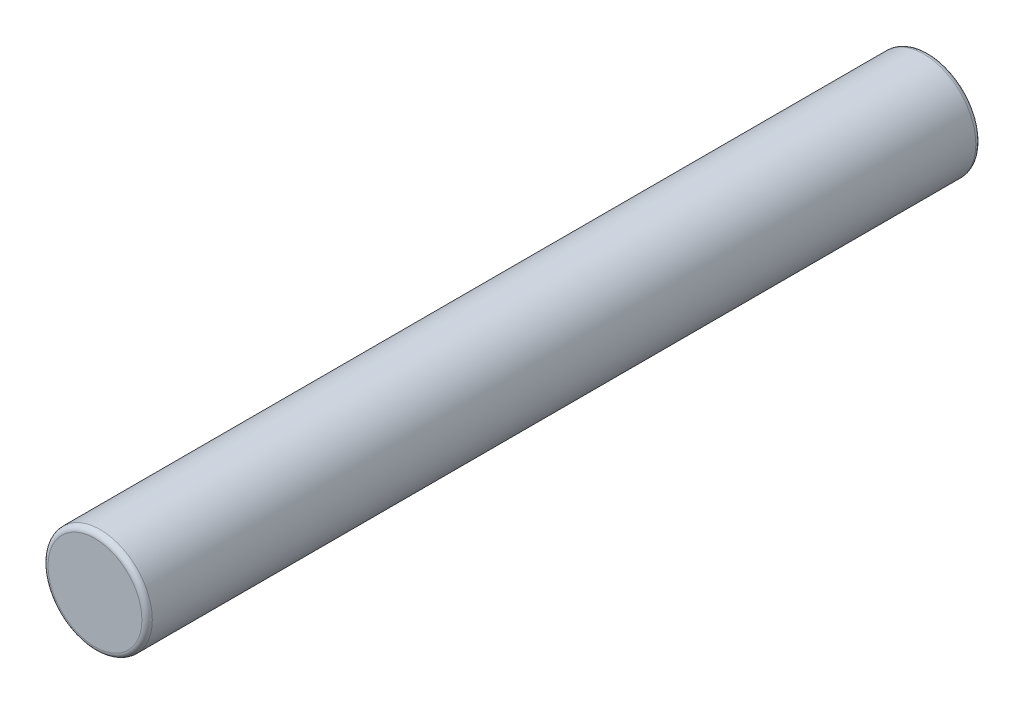
ISO-10303-21;
HEADER;
FILE_DESCRIPTION(('STEP AP214'),'2;1');
FILE_NAME('part.step','',(''),(''),'','','');
FILE_SCHEMA(('AUTOMOTIVE_DESIGN { 1 0 10303 214 1 1 1 1 }'));
ENDSEC;
DATA;
#1=APPLICATION_CONTEXT('core data for automotive mechanical design processes');
#2=APPLICATION_PROTOCOL_DEFINITION('international standard','automotive_design',2000,#1);
#3=PRODUCT_CONTEXT('',#1,'mechanical');
#4=PRODUCT('Part','Part','',(#3));
#5=PRODUCT_RELATED_PRODUCT_CATEGORY('part','',(#4));
#6=PRODUCT_DEFINITION_FORMATION('','',#4);
#7=PRODUCT_DEFINITION_CONTEXT('part definition',#1,'design');
#8=PRODUCT_DEFINITION('design','',#6,#7);
#9=PRODUCT_DEFINITION_SHAPE('','',#8);
#10=(LENGTH_UNIT() NAMED_UNIT(*) SI_UNIT(.MILLI.,.METRE.));
#11=(NAMED_UNIT(*) PLANE_ANGLE_UNIT() SI_UNIT($,.RADIAN.));
#12=(NAMED_UNIT(*) SI_UNIT($,.STERADIAN.) SOLID_ANGLE_UNIT());
#13=UNCERTAINTY_MEASURE_WITH_UNIT(LENGTH_MEASURE(1.E-05),#10,'distance_accuracy_value','');
#14=(GEOMETRIC_REPRESENTATION_CONTEXT(3) GLOBAL_UNCERTAINTY_ASSIGNED_CONTEXT((#13)) GLOBAL_UNIT_ASSIGNED_CONTEXT((#10,
#11,#12)) REPRESENTATION_CONTEXT('',''));
#15=CARTESIAN_POINT('',(0.,0.,0.));
#16=DIRECTION('',(0.,0.,1.));
#17=DIRECTION('',(1.,0.,0.));
#18=AXIS2_PLACEMENT_3D('',#15,#16,#17);
#19=CARTESIAN_POINT('',(-44.4890396438414,13.7311850752597,16.));
#20=DIRECTION('',(0.,0.,-1.));
#21=DIRECTION('',(-1.,0.,0.));
#22=AXIS2_PLACEMENT_3D('',#19,#20,#21);
#23=CYLINDRICAL_SURFACE('',#22,0.999999999999998);
#24=CARTESIAN_POINT('',(-44.4890396438414,13.7311850752597,0.0999999999999994));
#25=DIRECTION('',(0.,0.,1.));
#26=DIRECTION('',(1.,0.,0.));
#27=AXIS2_PLACEMENT_3D('',#24,#25,#26);
#28=CIRCLE('',#27,0.999999999999998);
#29=CARTESIAN_POINT('',(-43.4890396438414,13.7311850752597,0.0999999999999994));
#30=VERTEX_POINT('',#29);
#31=EDGE_CURVE('E42',#30,#30,#28,.T.);
#32=ORIENTED_EDGE('',*,*,#31,.T.);
#33=EDGE_LOOP('',(#32));
#34=FACE_BOUND('',#33,.T.);
#35=CARTESIAN_POINT('',(-44.4890396438414,13.7311850752597,15.9));
#36=DIRECTION('',(0.,0.,1.));
#37=DIRECTION('',(1.,0.,0.));
#38=AXIS2_PLACEMENT_3D('',#35,#36,#37);
#39=CIRCLE('',#38,0.999999999999998);
#40=CARTESIAN_POINT('',(-43.4890396438414,13.7311850752597,15.9));
#41=VERTEX_POINT('',#40);
#42=EDGE_CURVE('E46',#41,#41,#39,.F.);
#43=ORIENTED_EDGE('',*,*,#42,.T.);
#44=EDGE_LOOP('',(#43));
#45=FACE_BOUND('',#44,.T.);
#46=ADVANCED_FACE('F31',(#34,#45),#23,.T.);
#47=CARTESIAN_POINT('',(-44.4890396438414,13.7311850752597,16.));
#48=DIRECTION('',(0.,0.,1.));
#49=DIRECTION('',(1.,0.,0.));
#50=AXIS2_PLACEMENT_3D('',#47,#48,#49);
#51=PLANE('',#50);
#52=CARTESIAN_POINT('',(-44.4890396438414,13.7311850752597,16.));
#53=DIRECTION('',(0.,0.,1.));
#54=DIRECTION('',(1.,0.,0.));
#55=AXIS2_PLACEMENT_3D('',#52,#53,#54);
#56=CIRCLE('',#55,0.899999999999998);
#57=CARTESIAN_POINT('',(-43.5890396438414,13.7311850752597,16.));
#58=VERTEX_POINT('',#57);
#59=EDGE_CURVE('E10',#58,#58,#56,.T.);
#60=ORIENTED_EDGE('',*,*,#59,.T.);
#61=EDGE_LOOP('',(#60));
#62=FACE_BOUND('',#61,.T.);
#63=ADVANCED_FACE('F62',(#62),#51,.T.);
#64=CARTESIAN_POINT('',(-44.4890396438414,13.7311850752597,0.));
#65=DIRECTION('',(0.,0.,1.));
#66=DIRECTION('',(1.,0.,0.));
#67=AXIS2_PLACEMENT_3D('',#64,#65,#66);
#68=PLANE('',#67);
#69=CARTESIAN_POINT('',(-44.4890396438414,13.7311850752597,0.));
#70=DIRECTION('',(0.,0.,1.));
#71=DIRECTION('',(1.,0.,0.));
#72=AXIS2_PLACEMENT_3D('',#69,#70,#71);
#73=CIRCLE('',#72,0.899999999999998);
#74=CARTESIAN_POINT('',(-43.5890396438414,13.7311850752597,0.));
#75=VERTEX_POINT('',#74);
#76=EDGE_CURVE('E38',#75,#75,#73,.F.);
#77=ORIENTED_EDGE('',*,*,#76,.T.);
#78=EDGE_LOOP('',(#77));
#79=FACE_BOUND('',#78,.T.);
#80=ADVANCED_FACE('F59',(#79),#68,.F.);
#81=CARTESIAN_POINT('',(-44.4890396438414,13.7311850752597,0.0999999999999994));
#82=DIRECTION('',(0.,0.,1.));
#83=DIRECTION('',(1.,0.,0.));
#84=AXIS2_PLACEMENT_3D('',#81,#82,#83);
#85=TOROIDAL_SURFACE('',#84,0.899999999999998,0.1);
#86=ORIENTED_EDGE('',*,*,#76,.F.);
#87=EDGE_LOOP('',(#86));
#88=FACE_BOUND('',#87,.T.);
#89=ORIENTED_EDGE('',*,*,#31,.F.);
#90=EDGE_LOOP('',(#89));
#91=FACE_BOUND('',#90,.T.);
#92=ADVANCED_FACE('F55',(#88,#91),#85,.T.);
#93=CARTESIAN_POINT('',(-44.4890396438414,13.7311850752597,15.9));
#94=DIRECTION('',(0.,0.,1.));
#95=DIRECTION('',(1.,0.,0.));
#96=AXIS2_PLACEMENT_3D('',#93,#94,#95);
#97=TOROIDAL_SURFACE('',#96,0.899999999999998,0.1);
#98=ORIENTED_EDGE('',*,*,#42,.F.);
#99=EDGE_LOOP('',(#98));
#100=FACE_BOUND('',#99,.T.);
#101=ORIENTED_EDGE('',*,*,#59,.F.);
#102=EDGE_LOOP('',(#101));
#103=FACE_BOUND('',#102,.T.);
#104=ADVANCED_FACE('F33',(#100,#103),#97,.T.);
#105=CLOSED_SHELL('',(#46,#63,#80,#92,#104));
#106=MANIFOLD_SOLID_BREP('B2',#105);
#107=ADVANCED_BREP_SHAPE_REPRESENTATION('',(#18,#106),#14);
#108=SHAPE_DEFINITION_REPRESENTATION(#9,#107);
ENDSEC;
END-ISO-10303-21;
